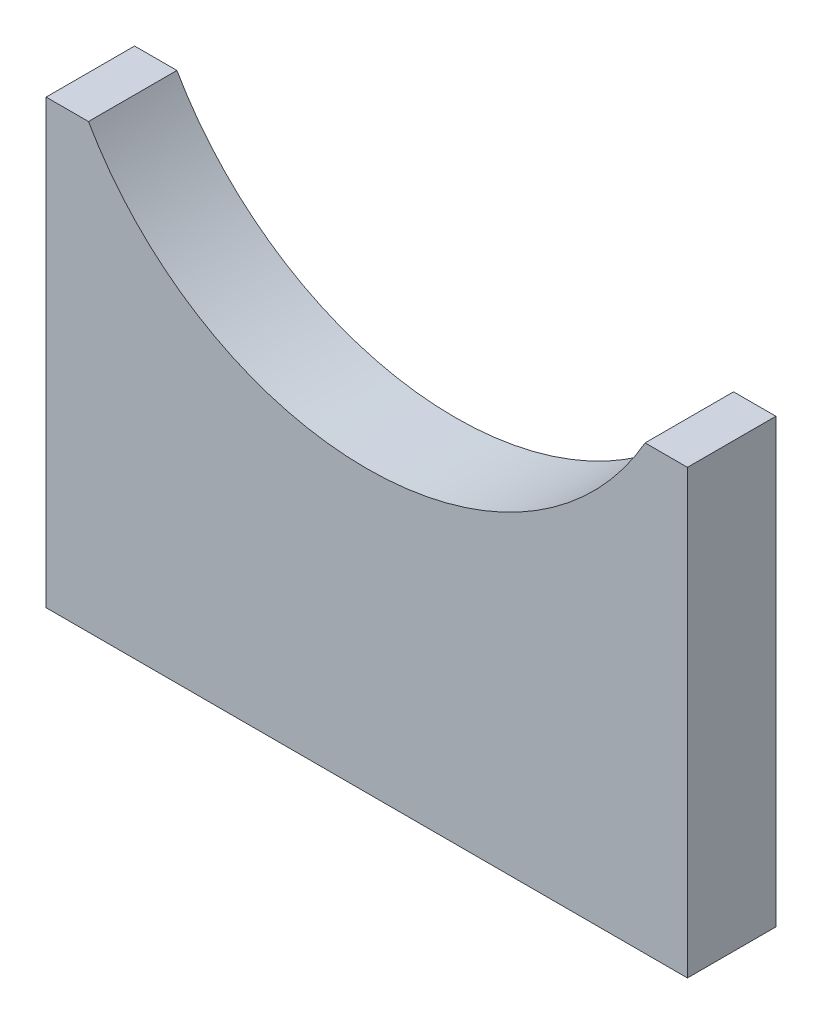
ISO-10303-21;
HEADER;
FILE_DESCRIPTION(('STEP AP214'),'2;1');
FILE_NAME('part.step','',(''),(''),'','','');
FILE_SCHEMA(('AUTOMOTIVE_DESIGN { 1 0 10303 214 1 1 1 1 }'));
ENDSEC;
DATA;
#1=APPLICATION_CONTEXT('core data for automotive mechanical design processes');
#2=APPLICATION_PROTOCOL_DEFINITION('international standard','automotive_design',2000,#1);
#3=PRODUCT_CONTEXT('',#1,'mechanical');
#4=PRODUCT('Part','Part','',(#3));
#5=PRODUCT_RELATED_PRODUCT_CATEGORY('part','',(#4));
#6=PRODUCT_DEFINITION_FORMATION('','',#4);
#7=PRODUCT_DEFINITION_CONTEXT('part definition',#1,'design');
#8=PRODUCT_DEFINITION('design','',#6,#7);
#9=PRODUCT_DEFINITION_SHAPE('','',#8);
#10=(LENGTH_UNIT() NAMED_UNIT(*) SI_UNIT(.MILLI.,.METRE.));
#11=(NAMED_UNIT(*) PLANE_ANGLE_UNIT() SI_UNIT($,.RADIAN.));
#12=(NAMED_UNIT(*) SI_UNIT($,.STERADIAN.) SOLID_ANGLE_UNIT());
#13=UNCERTAINTY_MEASURE_WITH_UNIT(LENGTH_MEASURE(1.E-05),#10,'distance_accuracy_value','');
#14=(GEOMETRIC_REPRESENTATION_CONTEXT(3) GLOBAL_UNCERTAINTY_ASSIGNED_CONTEXT((#13)) GLOBAL_UNIT_ASSIGNED_CONTEXT((#10,
#11,#12)) REPRESENTATION_CONTEXT('',''));
#15=CARTESIAN_POINT('',(0.,0.,0.));
#16=DIRECTION('',(0.,0.,1.));
#17=DIRECTION('',(1.,0.,0.));
#18=AXIS2_PLACEMENT_3D('',#15,#16,#17);
#19=CARTESIAN_POINT('',(-46.0375,0.,6.35));
#20=DIRECTION('',(1.,0.,0.));
#21=DIRECTION('',(0.,0.,-1.));
#22=AXIS2_PLACEMENT_3D('',#19,#20,#21);
#23=PLANE('',#22);
#24=DIRECTION('',(0.,-1.,0.));
#25=VECTOR('',#24,1.);
#26=CARTESIAN_POINT('',(-46.0375,0.,-6.35));
#27=LINE('',#26,#25);
#28=CARTESIAN_POINT('',(-46.0375,63.5,-6.35));
#29=VERTEX_POINT('',#28);
#30=CARTESIAN_POINT('',(-46.0375,0.,-6.35));
#31=VERTEX_POINT('',#30);
#32=EDGE_CURVE('E118',#29,#31,#27,.T.);
#33=ORIENTED_EDGE('',*,*,#32,.T.);
#34=DIRECTION('',(0.,0.,-1.));
#35=VECTOR('',#34,1.);
#36=CARTESIAN_POINT('',(-46.0375,0.,6.35));
#37=LINE('',#36,#35);
#38=CARTESIAN_POINT('',(-46.0375,0.,6.35));
#39=VERTEX_POINT('',#38);
#40=EDGE_CURVE('E11',#39,#31,#37,.T.);
#41=ORIENTED_EDGE('',*,*,#40,.F.);
#42=DIRECTION('',(0.,-1.,0.));
#43=VECTOR('',#42,1.);
#44=CARTESIAN_POINT('',(-46.0375,0.,6.35));
#45=LINE('',#44,#43);
#46=CARTESIAN_POINT('',(-46.0375,63.5,6.35));
#47=VERTEX_POINT('',#46);
#48=EDGE_CURVE('E129',#47,#39,#45,.T.);
#49=ORIENTED_EDGE('',*,*,#48,.F.);
#50=DIRECTION('',(0.,0.,-1.));
#51=VECTOR('',#50,1.);
#52=CARTESIAN_POINT('',(-46.0375,63.5,6.35));
#53=LINE('',#52,#51);
#54=EDGE_CURVE('E114',#47,#29,#53,.T.);
#55=ORIENTED_EDGE('',*,*,#54,.T.);
#56=EDGE_LOOP('',(#33,#41,#49,#55));
#57=FACE_BOUND('',#56,.T.);
#58=ADVANCED_FACE('F34',(#57),#23,.F.);
#59=CARTESIAN_POINT('',(46.0375,0.,6.35));
#60=DIRECTION('',(0.,1.,0.));
#61=DIRECTION('',(0.,0.,1.));
#62=AXIS2_PLACEMENT_3D('',#59,#60,#61);
#63=PLANE('',#62);
#64=CARTESIAN_POINT('',(38.1,0.,0.));
#65=DIRECTION('',(0.,-1.,0.));
#66=DIRECTION('',(0.,0.,-1.));
#67=AXIS2_PLACEMENT_3D('',#64,#65,#66);
#68=CIRCLE('',#67,3.3655);
#69=CARTESIAN_POINT('',(38.1,0.,-3.36549999999998));
#70=VERTEX_POINT('',#69);
#71=EDGE_CURVE('E245',#70,#70,#68,.T.);
#72=ORIENTED_EDGE('',*,*,#71,.F.);
#73=EDGE_LOOP('',(#72));
#74=FACE_BOUND('',#73,.T.);
#75=CARTESIAN_POINT('',(-38.1,0.,0.));
#76=DIRECTION('',(0.,-1.,0.));
#77=DIRECTION('',(0.,0.,-1.));
#78=AXIS2_PLACEMENT_3D('',#75,#76,#77);
#79=CIRCLE('',#78,3.3655);
#80=CARTESIAN_POINT('',(-38.1,0.,-3.3655));
#81=VERTEX_POINT('',#80);
#82=EDGE_CURVE('E244',#81,#81,#79,.T.);
#83=ORIENTED_EDGE('',*,*,#82,.F.);
#84=EDGE_LOOP('',(#83));
#85=FACE_BOUND('',#84,.T.);
#86=DIRECTION('',(1.,0.,0.));
#87=VECTOR('',#86,1.);
#88=CARTESIAN_POINT('',(46.0375,0.,-6.35));
#89=LINE('',#88,#87);
#90=CARTESIAN_POINT('',(46.0375,0.,-6.35));
#91=VERTEX_POINT('',#90);
#92=EDGE_CURVE('E121',#31,#91,#89,.T.);
#93=ORIENTED_EDGE('',*,*,#92,.T.);
#94=DIRECTION('',(0.,0.,-1.));
#95=VECTOR('',#94,1.);
#96=CARTESIAN_POINT('',(46.0375,0.,6.35));
#97=LINE('',#96,#95);
#98=CARTESIAN_POINT('',(46.0375,0.,6.35));
#99=VERTEX_POINT('',#98);
#100=EDGE_CURVE('E42',#99,#91,#97,.T.);
#101=ORIENTED_EDGE('',*,*,#100,.F.);
#102=DIRECTION('',(1.,0.,0.));
#103=VECTOR('',#102,1.);
#104=CARTESIAN_POINT('',(46.0375,0.,6.35));
#105=LINE('',#104,#103);
#106=EDGE_CURVE('E87',#39,#99,#105,.T.);
#107=ORIENTED_EDGE('',*,*,#106,.F.);
#108=ORIENTED_EDGE('',*,*,#40,.T.);
#109=EDGE_LOOP('',(#93,#101,#107,#108));
#110=FACE_BOUND('',#109,.T.);
#111=ADVANCED_FACE('F153',(#74,#85,#110),#63,.F.);
#112=CARTESIAN_POINT('',(46.0375,63.5,6.35));
#113=DIRECTION('',(-1.,0.,0.));
#114=DIRECTION('',(0.,0.,1.));
#115=AXIS2_PLACEMENT_3D('',#112,#113,#114);
#116=PLANE('',#115);
#117=DIRECTION('',(0.,1.,0.));
#118=VECTOR('',#117,1.);
#119=CARTESIAN_POINT('',(46.0375,63.5,-6.35));
#120=LINE('',#119,#118);
#121=CARTESIAN_POINT('',(46.0375,63.5,-6.35));
#122=VERTEX_POINT('',#121);
#123=EDGE_CURVE('E124',#91,#122,#120,.T.);
#124=ORIENTED_EDGE('',*,*,#123,.T.);
#125=DIRECTION('',(0.,0.,-1.));
#126=VECTOR('',#125,1.);
#127=CARTESIAN_POINT('',(46.0375,63.5,6.35));
#128=LINE('',#127,#126);
#129=CARTESIAN_POINT('',(46.0375,63.5,6.35));
#130=VERTEX_POINT('',#129);
#131=EDGE_CURVE('E109',#130,#122,#128,.T.);
#132=ORIENTED_EDGE('',*,*,#131,.F.);
#133=DIRECTION('',(0.,1.,0.));
#134=VECTOR('',#133,1.);
#135=CARTESIAN_POINT('',(46.0375,63.5,6.35));
#136=LINE('',#135,#134);
#137=EDGE_CURVE('E100',#99,#130,#136,.T.);
#138=ORIENTED_EDGE('',*,*,#137,.F.);
#139=ORIENTED_EDGE('',*,*,#100,.T.);
#140=EDGE_LOOP('',(#124,#132,#138,#139));
#141=FACE_BOUND('',#140,.T.);
#142=ADVANCED_FACE('F135',(#141),#116,.F.);
#143=CARTESIAN_POINT('',(39.9608784469261,63.5,6.35));
#144=DIRECTION('',(0.,-1.,0.));
#145=DIRECTION('',(0.,0.,-1.));
#146=AXIS2_PLACEMENT_3D('',#143,#144,#145);
#147=PLANE('',#146);
#148=DIRECTION('',(-1.,0.,0.));
#149=VECTOR('',#148,1.);
#150=CARTESIAN_POINT('',(39.9608784469261,63.5,-6.35));
#151=LINE('',#150,#149);
#152=CARTESIAN_POINT('',(39.9608784469261,63.5,-6.35));
#153=VERTEX_POINT('',#152);
#154=EDGE_CURVE('E108',#122,#153,#151,.T.);
#155=ORIENTED_EDGE('',*,*,#154,.T.);
#156=DIRECTION('',(0.,0.,-1.));
#157=VECTOR('',#156,1.);
#158=CARTESIAN_POINT('',(39.9608784469261,63.5,6.35));
#159=LINE('',#158,#157);
#160=CARTESIAN_POINT('',(39.9608784469261,63.5,6.35));
#161=VERTEX_POINT('',#160);
#162=EDGE_CURVE('E105',#161,#153,#159,.T.);
#163=ORIENTED_EDGE('',*,*,#162,.F.);
#164=DIRECTION('',(-1.,0.,0.));
#165=VECTOR('',#164,1.);
#166=CARTESIAN_POINT('',(39.9608784469261,63.5,6.35));
#167=LINE('',#166,#165);
#168=EDGE_CURVE('E94',#130,#161,#167,.T.);
#169=ORIENTED_EDGE('',*,*,#168,.F.);
#170=ORIENTED_EDGE('',*,*,#131,.T.);
#171=EDGE_LOOP('',(#155,#163,#169,#170));
#172=FACE_BOUND('',#171,.T.);
#173=ADVANCED_FACE('F106',(#172),#147,.F.);
#174=CARTESIAN_POINT('',(0.,86.36,6.35));
#175=DIRECTION('',(0.,0.,-1.));
#176=DIRECTION('',(-1.,0.,0.));
#177=AXIS2_PLACEMENT_3D('',#174,#175,#176);
#178=CYLINDRICAL_SURFACE('',#177,46.0375);
#179=CARTESIAN_POINT('',(0.,86.36,-6.35));
#180=DIRECTION('',(0.,0.,-1.));
#181=DIRECTION('',(1.,0.,0.));
#182=AXIS2_PLACEMENT_3D('',#179,#180,#181);
#183=CIRCLE('',#182,46.0375);
#184=CARTESIAN_POINT('',(-39.9608784469261,63.5,-6.35));
#185=VERTEX_POINT('',#184);
#186=EDGE_CURVE('E73',#153,#185,#183,.T.);
#187=ORIENTED_EDGE('',*,*,#186,.T.);
#188=DIRECTION('',(0.,0.,-1.));
#189=VECTOR('',#188,1.);
#190=CARTESIAN_POINT('',(-39.9608784469261,63.5,6.35));
#191=LINE('',#190,#189);
#192=CARTESIAN_POINT('',(-39.9608784469261,63.5,6.35));
#193=VERTEX_POINT('',#192);
#194=EDGE_CURVE('E110',#193,#185,#191,.T.);
#195=ORIENTED_EDGE('',*,*,#194,.F.);
#196=CARTESIAN_POINT('',(0.,86.36,6.35));
#197=DIRECTION('',(0.,0.,-1.));
#198=DIRECTION('',(1.,0.,0.));
#199=AXIS2_PLACEMENT_3D('',#196,#197,#198);
#200=CIRCLE('',#199,46.0375);
#201=EDGE_CURVE('E98',#161,#193,#200,.T.);
#202=ORIENTED_EDGE('',*,*,#201,.F.);
#203=ORIENTED_EDGE('',*,*,#162,.T.);
#204=EDGE_LOOP('',(#187,#195,#202,#203));
#205=FACE_BOUND('',#204,.T.);
#206=ADVANCED_FACE('F112',(#205),#178,.F.);
#207=CARTESIAN_POINT('',(-46.0375,63.5,6.35));
#208=DIRECTION('',(0.,-1.,0.));
#209=DIRECTION('',(0.,0.,-1.));
#210=AXIS2_PLACEMENT_3D('',#207,#208,#209);
#211=PLANE('',#210);
#212=DIRECTION('',(-1.,0.,0.));
#213=VECTOR('',#212,1.);
#214=CARTESIAN_POINT('',(-46.0375,63.5,-6.35));
#215=LINE('',#214,#213);
#216=EDGE_CURVE('E79',#185,#29,#215,.T.);
#217=ORIENTED_EDGE('',*,*,#216,.T.);
#218=ORIENTED_EDGE('',*,*,#54,.F.);
#219=DIRECTION('',(-1.,0.,0.));
#220=VECTOR('',#219,1.);
#221=CARTESIAN_POINT('',(-46.0375,63.5,6.35));
#222=LINE('',#221,#220);
#223=EDGE_CURVE('E50',#193,#47,#222,.T.);
#224=ORIENTED_EDGE('',*,*,#223,.F.);
#225=ORIENTED_EDGE('',*,*,#194,.T.);
#226=EDGE_LOOP('',(#217,#218,#224,#225));
#227=FACE_BOUND('',#226,.T.);
#228=ADVANCED_FACE('F142',(#227),#211,.F.);
#229=CARTESIAN_POINT('',(0.,86.36,6.35));
#230=DIRECTION('',(0.,0.,1.));
#231=DIRECTION('',(1.,0.,0.));
#232=AXIS2_PLACEMENT_3D('',#229,#230,#231);
#233=PLANE('',#232);
#234=ORIENTED_EDGE('',*,*,#48,.T.);
#235=ORIENTED_EDGE('',*,*,#106,.T.);
#236=ORIENTED_EDGE('',*,*,#137,.T.);
#237=ORIENTED_EDGE('',*,*,#168,.T.);
#238=ORIENTED_EDGE('',*,*,#201,.T.);
#239=ORIENTED_EDGE('',*,*,#223,.T.);
#240=EDGE_LOOP('',(#234,#235,#236,#237,#238,#239));
#241=FACE_BOUND('',#240,.T.);
#242=ADVANCED_FACE('F96',(#241),#233,.T.);
#243=CARTESIAN_POINT('',(0.,86.36,-6.35));
#244=DIRECTION('',(0.,0.,1.));
#245=DIRECTION('',(1.,0.,0.));
#246=AXIS2_PLACEMENT_3D('',#243,#244,#245);
#247=PLANE('',#246);
#248=ORIENTED_EDGE('',*,*,#32,.F.);
#249=ORIENTED_EDGE('',*,*,#216,.F.);
#250=ORIENTED_EDGE('',*,*,#186,.F.);
#251=ORIENTED_EDGE('',*,*,#154,.F.);
#252=ORIENTED_EDGE('',*,*,#123,.F.);
#253=ORIENTED_EDGE('',*,*,#92,.F.);
#254=EDGE_LOOP('',(#248,#249,#250,#251,#252,#253));
#255=FACE_BOUND('',#254,.T.);
#256=ADVANCED_FACE('F138',(#255),#247,.F.);
#257=CARTESIAN_POINT('',(-38.1,12.7,0.));
#258=DIRECTION('',(0.,-1.,0.));
#259=DIRECTION('',(0.,0.,-1.));
#260=AXIS2_PLACEMENT_3D('',#257,#258,#259);
#261=CYLINDRICAL_SURFACE('',#260,3.3655);
#262=CARTESIAN_POINT('',(-38.1,12.7,0.));
#263=DIRECTION('',(0.,-1.,0.));
#264=DIRECTION('',(0.,0.,-1.));
#265=AXIS2_PLACEMENT_3D('',#262,#263,#264);
#266=CIRCLE('',#265,3.3655);
#267=CARTESIAN_POINT('',(-38.1,12.7,-3.3655));
#268=VERTEX_POINT('',#267);
#269=EDGE_CURVE('E122',#268,#268,#266,.T.);
#270=ORIENTED_EDGE('',*,*,#269,.F.);
#271=EDGE_LOOP('',(#270));
#272=FACE_BOUND('',#271,.T.);
#273=ORIENTED_EDGE('',*,*,#82,.T.);
#274=EDGE_LOOP('',(#273));
#275=FACE_BOUND('',#274,.T.);
#276=ADVANCED_FACE('F192',(#272,#275),#261,.F.);
#277=CARTESIAN_POINT('',(-38.1,12.7,0.));
#278=DIRECTION('',(0.,-1.,0.));
#279=DIRECTION('',(0.,0.,-1.));
#280=AXIS2_PLACEMENT_3D('',#277,#278,#279);
#281=PLANE('',#280);
#282=ORIENTED_EDGE('',*,*,#269,.T.);
#283=EDGE_LOOP('',(#282));
#284=FACE_BOUND('',#283,.T.);
#285=ADVANCED_FACE('F207',(#284),#281,.T.);
#286=CARTESIAN_POINT('',(38.1,12.7,0.));
#287=DIRECTION('',(0.,-1.,0.));
#288=DIRECTION('',(0.,0.,-1.));
#289=AXIS2_PLACEMENT_3D('',#286,#287,#288);
#290=CYLINDRICAL_SURFACE('',#289,3.3655);
#291=CARTESIAN_POINT('',(38.1,12.7,0.));
#292=DIRECTION('',(0.,-1.,0.));
#293=DIRECTION('',(0.,0.,-1.));
#294=AXIS2_PLACEMENT_3D('',#291,#292,#293);
#295=CIRCLE('',#294,3.3655);
#296=CARTESIAN_POINT('',(38.1,12.7,-3.36549999999998));
#297=VERTEX_POINT('',#296);
#298=EDGE_CURVE('E243',#297,#297,#295,.T.);
#299=ORIENTED_EDGE('',*,*,#298,.F.);
#300=EDGE_LOOP('',(#299));
#301=FACE_BOUND('',#300,.T.);
#302=ORIENTED_EDGE('',*,*,#71,.T.);
#303=EDGE_LOOP('',(#302));
#304=FACE_BOUND('',#303,.T.);
#305=ADVANCED_FACE('F217',(#301,#304),#290,.F.);
#306=CARTESIAN_POINT('',(38.1,12.7,0.));
#307=DIRECTION('',(0.,-1.,0.));
#308=DIRECTION('',(0.,0.,-1.));
#309=AXIS2_PLACEMENT_3D('',#306,#307,#308);
#310=PLANE('',#309);
#311=ORIENTED_EDGE('',*,*,#298,.T.);
#312=EDGE_LOOP('',(#311));
#313=FACE_BOUND('',#312,.T.);
#314=ADVANCED_FACE('F227',(#313),#310,.T.);
#315=CLOSED_SHELL('',(#58,#111,#142,#173,#206,#228,#242,#256,#276,#285,#305,#314));
#316=MANIFOLD_SOLID_BREP('B2',#315);
#317=ADVANCED_BREP_SHAPE_REPRESENTATION('',(#18,#316),#14);
#318=SHAPE_DEFINITION_REPRESENTATION(#9,#317);
ENDSEC;
END-ISO-10303-21;
